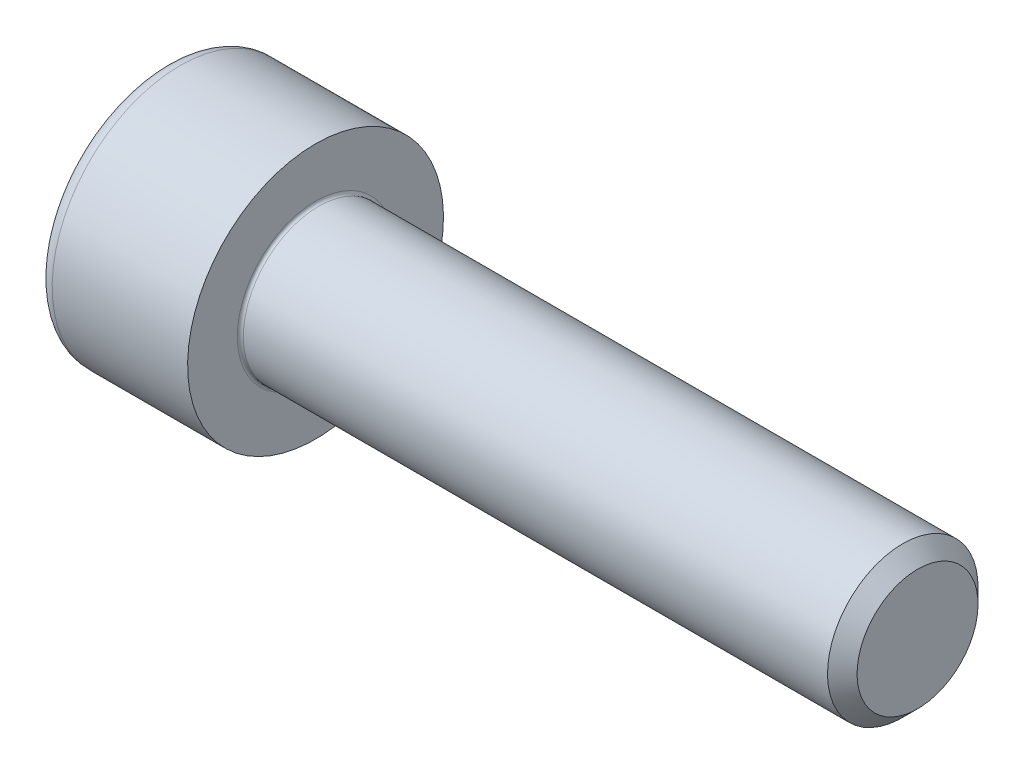
ISO-10303-21;
HEADER;
FILE_DESCRIPTION(('STEP AP214'),'2;1');
FILE_NAME('part.step','',(''),(''),'','','');
FILE_SCHEMA(('AUTOMOTIVE_DESIGN { 1 0 10303 214 1 1 1 1 }'));
ENDSEC;
DATA;
#1=APPLICATION_CONTEXT('core data for automotive mechanical design processes');
#2=APPLICATION_PROTOCOL_DEFINITION('international standard','automotive_design',2000,#1);
#3=PRODUCT_CONTEXT('',#1,'mechanical');
#4=PRODUCT('Part','Part','',(#3));
#5=PRODUCT_RELATED_PRODUCT_CATEGORY('part','',(#4));
#6=PRODUCT_DEFINITION_FORMATION('','',#4);
#7=PRODUCT_DEFINITION_CONTEXT('part definition',#1,'design');
#8=PRODUCT_DEFINITION('design','',#6,#7);
#9=PRODUCT_DEFINITION_SHAPE('','',#8);
#10=(LENGTH_UNIT() NAMED_UNIT(*) SI_UNIT(.MILLI.,.METRE.));
#11=(NAMED_UNIT(*) PLANE_ANGLE_UNIT() SI_UNIT($,.RADIAN.));
#12=(NAMED_UNIT(*) SI_UNIT($,.STERADIAN.) SOLID_ANGLE_UNIT());
#13=UNCERTAINTY_MEASURE_WITH_UNIT(LENGTH_MEASURE(1.E-05),#10,'distance_accuracy_value','');
#14=(GEOMETRIC_REPRESENTATION_CONTEXT(3) GLOBAL_UNCERTAINTY_ASSIGNED_CONTEXT((#13)) GLOBAL_UNIT_ASSIGNED_CONTEXT((#10,
#11,#12)) REPRESENTATION_CONTEXT('',''));
#15=CARTESIAN_POINT('',(0.,0.,0.));
#16=DIRECTION('',(0.,0.,1.));
#17=DIRECTION('',(1.,0.,0.));
#18=AXIS2_PLACEMENT_3D('',#15,#16,#17);
#19=CARTESIAN_POINT('',(-1.83333333333333,0.,0.));
#20=DIRECTION('',(-1.,0.,0.));
#21=DIRECTION('',(0.,1.,0.));
#22=AXIS2_PLACEMENT_3D('',#19,#20,#21);
#23=CONICAL_SURFACE('',#22,1.15470053837925,1.0471975511966);
#24=CARTESIAN_POINT('',(-1.16666666666667,0.,0.));
#25=VERTEX_POINT('',#24);
#26=VERTEX_LOOP('',#25);
#27=FACE_BOUND('',#26,.T.);
#28=CARTESIAN_POINT('',(-2.5,0.,2.30940107675851));
#29=CARTESIAN_POINT('',(-2.16666666666666,1.,1.73205080756886));
#30=CARTESIAN_POINT('',(-2.5,2.,1.15470053837925));
#31=(BOUNDED_CURVE() B_SPLINE_CURVE(2,(#28,#29,#30),.UNSPECIFIED.,.F.,
.F.) B_SPLINE_CURVE_WITH_KNOTS((3,3),(0.,0.233687227615586),
.UNSPECIFIED.) CURVE() GEOMETRIC_REPRESENTATION_ITEM() RATIONAL_B_SPLINE_CURVE((1.,
1.15470053837926,1.)) REPRESENTATION_ITEM(''));
#32=CARTESIAN_POINT('',(-2.5,0.,2.3094010767585));
#33=VERTEX_POINT('',#32);
#34=CARTESIAN_POINT('',(-2.5,2.,1.15470053837925));
#35=VERTEX_POINT('',#34);
#36=EDGE_CURVE('E159',#33,#35,#31,.T.);
#37=ORIENTED_EDGE('',*,*,#36,.T.);
#38=CARTESIAN_POINT('',(-2.5,2.,1.15470053837926));
#39=CARTESIAN_POINT('',(-2.16666666666666,2.,0.));
#40=CARTESIAN_POINT('',(-2.5,2.,-1.15470053837926));
#41=(BOUNDED_CURVE() B_SPLINE_CURVE(2,(#38,#39,#40),.UNSPECIFIED.,.F.,
.F.) B_SPLINE_CURVE_WITH_KNOTS((3,3),(0.,0.233687227615586),
.UNSPECIFIED.) CURVE() GEOMETRIC_REPRESENTATION_ITEM() RATIONAL_B_SPLINE_CURVE((1.,
1.15470053837926,1.)) REPRESENTATION_ITEM(''));
#42=CARTESIAN_POINT('',(-2.5,2.,-1.15470053837925));
#43=VERTEX_POINT('',#42);
#44=EDGE_CURVE('E183',#35,#43,#41,.T.);
#45=ORIENTED_EDGE('',*,*,#44,.T.);
#46=CARTESIAN_POINT('',(-2.5,2.,-1.15470053837925));
#47=CARTESIAN_POINT('',(-2.16666666666666,1.,-1.73205080756888));
#48=CARTESIAN_POINT('',(-2.5,0.,-2.30940107675851));
#49=(BOUNDED_CURVE() B_SPLINE_CURVE(2,(#46,#47,#48),.UNSPECIFIED.,.F.,
.F.) B_SPLINE_CURVE_WITH_KNOTS((3,3),(0.,0.233687227615586),
.UNSPECIFIED.) CURVE() GEOMETRIC_REPRESENTATION_ITEM() RATIONAL_B_SPLINE_CURVE((1.,
1.15470053837925,1.)) REPRESENTATION_ITEM(''));
#50=CARTESIAN_POINT('',(-2.5,0.,-2.3094010767585));
#51=VERTEX_POINT('',#50);
#52=EDGE_CURVE('E181',#43,#51,#49,.T.);
#53=ORIENTED_EDGE('',*,*,#52,.T.);
#54=CARTESIAN_POINT('',(-2.5,0.,-2.30940107675851));
#55=CARTESIAN_POINT('',(-2.16666666666666,-1.,-1.73205080756886));
#56=CARTESIAN_POINT('',(-2.5,-2.,-1.15470053837925));
#57=(BOUNDED_CURVE() B_SPLINE_CURVE(2,(#54,#55,#56),.UNSPECIFIED.,.F.,
.F.) B_SPLINE_CURVE_WITH_KNOTS((3,3),(0.,0.233687227615586),
.UNSPECIFIED.) CURVE() GEOMETRIC_REPRESENTATION_ITEM() RATIONAL_B_SPLINE_CURVE((1.,
1.15470053837926,1.)) REPRESENTATION_ITEM(''));
#58=CARTESIAN_POINT('',(-2.5,-2.,-1.15470053837925));
#59=VERTEX_POINT('',#58);
#60=EDGE_CURVE('E129',#51,#59,#57,.T.);
#61=ORIENTED_EDGE('',*,*,#60,.T.);
#62=CARTESIAN_POINT('',(-2.5,-2.,-1.15470053837926));
#63=CARTESIAN_POINT('',(-2.16666666666666,-2.,0.));
#64=CARTESIAN_POINT('',(-2.5,-2.,1.15470053837926));
#65=(BOUNDED_CURVE() B_SPLINE_CURVE(2,(#62,#63,#64),.UNSPECIFIED.,.F.,
.F.) B_SPLINE_CURVE_WITH_KNOTS((3,3),(0.,0.233687227615586),
.UNSPECIFIED.) CURVE() GEOMETRIC_REPRESENTATION_ITEM() RATIONAL_B_SPLINE_CURVE((1.,
1.15470053837925,1.)) REPRESENTATION_ITEM(''));
#66=CARTESIAN_POINT('',(-2.5,-2.,1.15470053837925));
#67=VERTEX_POINT('',#66);
#68=EDGE_CURVE('E180',#59,#67,#65,.T.);
#69=ORIENTED_EDGE('',*,*,#68,.T.);
#70=CARTESIAN_POINT('',(-2.5,-2.,1.15470053837925));
#71=CARTESIAN_POINT('',(-2.16666666666666,-1.,1.73205080756886));
#72=CARTESIAN_POINT('',(-2.5,0.,2.30940107675851));
#73=(BOUNDED_CURVE() B_SPLINE_CURVE(2,(#70,#71,#72),.UNSPECIFIED.,.F.,
.F.) B_SPLINE_CURVE_WITH_KNOTS((3,3),(0.,0.233687227615586),
.UNSPECIFIED.) CURVE() GEOMETRIC_REPRESENTATION_ITEM() RATIONAL_B_SPLINE_CURVE((1.,
1.15470053837926,1.)) REPRESENTATION_ITEM(''));
#74=EDGE_CURVE('E11',#67,#33,#73,.T.);
#75=ORIENTED_EDGE('',*,*,#74,.T.);
#76=EDGE_LOOP('',(#37,#45,#53,#61,#69,#75));
#77=FACE_BOUND('',#76,.T.);
#78=ADVANCED_FACE('F16',(#27,#77),#23,.F.);
#79=CARTESIAN_POINT('',(-5.,-2.,1.15470053837925));
#80=DIRECTION('',(0.,-0.5,0.866025403784439));
#81=DIRECTION('',(-1.,0.,0.));
#82=AXIS2_PLACEMENT_3D('',#79,#80,#81);
#83=PLANE('',#82);
#84=ORIENTED_EDGE('',*,*,#74,.F.);
#85=DIRECTION('',(-1.,0.,0.));
#86=VECTOR('',#85,1.);
#87=CARTESIAN_POINT('',(-3.75,-2.,1.15470053837925));
#88=LINE('',#87,#86);
#89=CARTESIAN_POINT('',(-5.,-2.,1.15470053837925));
#90=VERTEX_POINT('',#89);
#91=EDGE_CURVE('E26',#67,#90,#88,.T.);
#92=ORIENTED_EDGE('',*,*,#91,.T.);
#93=DIRECTION('',(0.,-0.866025403784439,-0.5));
#94=VECTOR('',#93,1.);
#95=CARTESIAN_POINT('',(-5.,-1.5,1.44337567297406));
#96=LINE('',#95,#94);
#97=CARTESIAN_POINT('',(-5.,0.,2.3094010767585));
#98=VERTEX_POINT('',#97);
#99=EDGE_CURVE('E154',#98,#90,#96,.T.);
#100=ORIENTED_EDGE('',*,*,#99,.F.);
#101=DIRECTION('',(1.,0.,0.));
#102=VECTOR('',#101,1.);
#103=CARTESIAN_POINT('',(-3.75,0.,2.3094010767585));
#104=LINE('',#103,#102);
#105=EDGE_CURVE('E83',#98,#33,#104,.T.);
#106=ORIENTED_EDGE('',*,*,#105,.T.);
#107=EDGE_LOOP('',(#84,#92,#100,#106));
#108=FACE_BOUND('',#107,.T.);
#109=ADVANCED_FACE('F253',(#108),#83,.F.);
#110=CARTESIAN_POINT('',(-5.,-2.,-1.15470053837925));
#111=DIRECTION('',(0.,-1.,0.));
#112=DIRECTION('',(-1.,0.,0.));
#113=AXIS2_PLACEMENT_3D('',#110,#111,#112);
#114=PLANE('',#113);
#115=ORIENTED_EDGE('',*,*,#68,.F.);
#116=DIRECTION('',(-1.,0.,0.));
#117=VECTOR('',#116,1.);
#118=CARTESIAN_POINT('',(-3.75,-2.,-1.15470053837925));
#119=LINE('',#118,#117);
#120=CARTESIAN_POINT('',(-5.,-2.,-1.15470053837925));
#121=VERTEX_POINT('',#120);
#122=EDGE_CURVE('E20',#59,#121,#119,.T.);
#123=ORIENTED_EDGE('',*,*,#122,.T.);
#124=DIRECTION('',(0.,0.,-1.));
#125=VECTOR('',#124,1.);
#126=CARTESIAN_POINT('',(-5.,-2.,-0.577350269189625));
#127=LINE('',#126,#125);
#128=EDGE_CURVE('E147',#90,#121,#127,.T.);
#129=ORIENTED_EDGE('',*,*,#128,.F.);
#130=ORIENTED_EDGE('',*,*,#91,.F.);
#131=EDGE_LOOP('',(#115,#123,#129,#130));
#132=FACE_BOUND('',#131,.T.);
#133=ADVANCED_FACE('F264',(#132),#114,.F.);
#134=CARTESIAN_POINT('',(-5.,0.,2.3094010767585));
#135=DIRECTION('',(0.,0.5,0.866025403784439));
#136=DIRECTION('',(1.,0.,0.));
#137=AXIS2_PLACEMENT_3D('',#134,#135,#136);
#138=PLANE('',#137);
#139=ORIENTED_EDGE('',*,*,#36,.F.);
#140=ORIENTED_EDGE('',*,*,#105,.F.);
#141=DIRECTION('',(0.,-0.866025403784439,0.5));
#142=VECTOR('',#141,1.);
#143=CARTESIAN_POINT('',(-5.,0.5,2.02072594216369));
#144=LINE('',#143,#142);
#145=CARTESIAN_POINT('',(-5.,2.,1.15470053837925));
#146=VERTEX_POINT('',#145);
#147=EDGE_CURVE('E169',#146,#98,#144,.T.);
#148=ORIENTED_EDGE('',*,*,#147,.F.);
#149=DIRECTION('',(-1.,0.,0.));
#150=VECTOR('',#149,1.);
#151=CARTESIAN_POINT('',(-3.75,2.,1.15470053837925));
#152=LINE('',#151,#150);
#153=EDGE_CURVE('E164',#35,#146,#152,.T.);
#154=ORIENTED_EDGE('',*,*,#153,.F.);
#155=EDGE_LOOP('',(#139,#140,#148,#154));
#156=FACE_BOUND('',#155,.T.);
#157=ADVANCED_FACE('F254',(#156),#138,.F.);
#158=CARTESIAN_POINT('',(-5.,2.,1.15470053837925));
#159=DIRECTION('',(0.,1.,0.));
#160=DIRECTION('',(0.,0.,-1.));
#161=AXIS2_PLACEMENT_3D('',#158,#159,#160);
#162=PLANE('',#161);
#163=ORIENTED_EDGE('',*,*,#44,.F.);
#164=ORIENTED_EDGE('',*,*,#153,.T.);
#165=DIRECTION('',(0.,0.,1.));
#166=VECTOR('',#165,1.);
#167=CARTESIAN_POINT('',(-5.,2.,0.577350269189624));
#168=LINE('',#167,#166);
#169=CARTESIAN_POINT('',(-5.,2.,-1.15470053837925));
#170=VERTEX_POINT('',#169);
#171=EDGE_CURVE('E222',#170,#146,#168,.T.);
#172=ORIENTED_EDGE('',*,*,#171,.F.);
#173=DIRECTION('',(-1.,0.,0.));
#174=VECTOR('',#173,1.);
#175=CARTESIAN_POINT('',(-3.75,2.,-1.15470053837925));
#176=LINE('',#175,#174);
#177=EDGE_CURVE('E138',#43,#170,#176,.T.);
#178=ORIENTED_EDGE('',*,*,#177,.F.);
#179=EDGE_LOOP('',(#163,#164,#172,#178));
#180=FACE_BOUND('',#179,.T.);
#181=ADVANCED_FACE('F255',(#180),#162,.F.);
#182=CARTESIAN_POINT('',(-5.,2.,-1.15470053837925));
#183=DIRECTION('',(0.,0.5,-0.866025403784439));
#184=DIRECTION('',(-1.,0.,0.));
#185=AXIS2_PLACEMENT_3D('',#182,#183,#184);
#186=PLANE('',#185);
#187=ORIENTED_EDGE('',*,*,#52,.F.);
#188=ORIENTED_EDGE('',*,*,#177,.T.);
#189=DIRECTION('',(0.,0.866025403784439,0.5));
#190=VECTOR('',#189,1.);
#191=CARTESIAN_POINT('',(-5.,1.5,-1.44337567297407));
#192=LINE('',#191,#190);
#193=CARTESIAN_POINT('',(-5.,0.,-2.3094010767585));
#194=VERTEX_POINT('',#193);
#195=EDGE_CURVE('E135',#194,#170,#192,.T.);
#196=ORIENTED_EDGE('',*,*,#195,.F.);
#197=DIRECTION('',(-1.,0.,0.));
#198=VECTOR('',#197,1.);
#199=CARTESIAN_POINT('',(-3.75,0.,-2.3094010767585));
#200=LINE('',#199,#198);
#201=EDGE_CURVE('E121',#51,#194,#200,.T.);
#202=ORIENTED_EDGE('',*,*,#201,.F.);
#203=EDGE_LOOP('',(#187,#188,#196,#202));
#204=FACE_BOUND('',#203,.T.);
#205=ADVANCED_FACE('F136',(#204),#186,.F.);
#206=CARTESIAN_POINT('',(-5.,0.,-2.3094010767585));
#207=DIRECTION('',(0.,-0.5,-0.866025403784439));
#208=DIRECTION('',(0.,-0.866025403784439,0.5));
#209=AXIS2_PLACEMENT_3D('',#206,#207,#208);
#210=PLANE('',#209);
#211=ORIENTED_EDGE('',*,*,#60,.F.);
#212=ORIENTED_EDGE('',*,*,#201,.T.);
#213=DIRECTION('',(0.,0.866025403784439,-0.5));
#214=VECTOR('',#213,1.);
#215=CARTESIAN_POINT('',(-5.,-0.5,-2.02072594216369));
#216=LINE('',#215,#214);
#217=EDGE_CURVE('E126',#121,#194,#216,.T.);
#218=ORIENTED_EDGE('',*,*,#217,.F.);
#219=ORIENTED_EDGE('',*,*,#122,.F.);
#220=EDGE_LOOP('',(#211,#212,#218,#219));
#221=FACE_BOUND('',#220,.T.);
#222=ADVANCED_FACE('F123',(#221),#210,.F.);
#223=CARTESIAN_POINT('',(-2.5,0.,0.));
#224=DIRECTION('',(1.,0.,0.));
#225=DIRECTION('',(0.,1.,0.));
#226=AXIS2_PLACEMENT_3D('',#223,#224,#225);
#227=CYLINDRICAL_SURFACE('',#226,4.25);
#228=CARTESIAN_POINT('',(-4.5,0.,0.));
#229=DIRECTION('',(-1.,0.,0.));
#230=DIRECTION('',(0.,-1.,0.));
#231=AXIS2_PLACEMENT_3D('',#228,#229,#230);
#232=CIRCLE('',#231,4.25);
#233=CARTESIAN_POINT('',(-4.5,4.25,0.));
#234=VERTEX_POINT('',#233);
#235=EDGE_CURVE('E200',#234,#234,#232,.T.);
#236=ORIENTED_EDGE('',*,*,#235,.F.);
#237=EDGE_LOOP('',(#236));
#238=FACE_BOUND('',#237,.T.);
#239=CARTESIAN_POINT('',(0.,0.,0.));
#240=DIRECTION('',(1.,0.,0.));
#241=DIRECTION('',(0.,1.,0.));
#242=AXIS2_PLACEMENT_3D('',#239,#240,#241);
#243=CIRCLE('',#242,4.25);
#244=CARTESIAN_POINT('',(0.,4.25,0.));
#245=VERTEX_POINT('',#244);
#246=EDGE_CURVE('E217',#245,#245,#243,.T.);
#247=ORIENTED_EDGE('',*,*,#246,.F.);
#248=EDGE_LOOP('',(#247));
#249=FACE_BOUND('',#248,.T.);
#250=ADVANCED_FACE('F282',(#238,#249),#227,.T.);
#251=CARTESIAN_POINT('',(-5.,3.27970053837925,0.));
#252=DIRECTION('',(-1.,0.,0.));
#253=DIRECTION('',(0.,1.,0.));
#254=AXIS2_PLACEMENT_3D('',#251,#252,#253);
#255=PLANE('',#254);
#256=ORIENTED_EDGE('',*,*,#171,.T.);
#257=ORIENTED_EDGE('',*,*,#147,.T.);
#258=ORIENTED_EDGE('',*,*,#99,.T.);
#259=ORIENTED_EDGE('',*,*,#128,.T.);
#260=ORIENTED_EDGE('',*,*,#217,.T.);
#261=ORIENTED_EDGE('',*,*,#195,.T.);
#262=EDGE_LOOP('',(#256,#257,#258,#259,#260,#261));
#263=FACE_BOUND('',#262,.T.);
#264=CARTESIAN_POINT('',(-5.,0.,0.));
#265=DIRECTION('',(1.,0.,0.));
#266=DIRECTION('',(0.,-1.,0.));
#267=AXIS2_PLACEMENT_3D('',#264,#265,#266);
#268=CIRCLE('',#267,3.75);
#269=CARTESIAN_POINT('',(-5.,3.75,0.));
#270=VERTEX_POINT('',#269);
#271=EDGE_CURVE('E194',#270,#270,#268,.T.);
#272=ORIENTED_EDGE('',*,*,#271,.F.);
#273=EDGE_LOOP('',(#272));
#274=FACE_BOUND('',#273,.T.);
#275=ADVANCED_FACE('F144',(#263,#274),#255,.T.);
#276=CARTESIAN_POINT('',(-4.5,0.,0.));
#277=DIRECTION('',(1.,0.,0.));
#278=DIRECTION('',(0.,0.,-1.));
#279=AXIS2_PLACEMENT_3D('',#276,#277,#278);
#280=TOROIDAL_SURFACE('',#279,3.75,0.5);
#281=ORIENTED_EDGE('',*,*,#235,.T.);
#282=EDGE_LOOP('',(#281));
#283=FACE_BOUND('',#282,.T.);
#284=ORIENTED_EDGE('',*,*,#271,.T.);
#285=EDGE_LOOP('',(#284));
#286=FACE_BOUND('',#285,.T.);
#287=ADVANCED_FACE('F279',(#283,#286),#280,.T.);
#288=CARTESIAN_POINT('',(20.,1.25,0.));
#289=DIRECTION('',(1.,0.,0.));
#290=DIRECTION('',(0.,1.,0.));
#291=AXIS2_PLACEMENT_3D('',#288,#289,#290);
#292=PLANE('',#291);
#293=CARTESIAN_POINT('',(20.,0.,0.));
#294=DIRECTION('',(-1.,0.,0.));
#295=DIRECTION('',(0.,-1.,0.));
#296=AXIS2_PLACEMENT_3D('',#293,#294,#295);
#297=CIRCLE('',#296,2.00924);
#298=CARTESIAN_POINT('',(20.,2.00924,0.));
#299=VERTEX_POINT('',#298);
#300=EDGE_CURVE('E201',#299,#299,#297,.T.);
#301=ORIENTED_EDGE('',*,*,#300,.F.);
#302=EDGE_LOOP('',(#301));
#303=FACE_BOUND('',#302,.T.);
#304=ADVANCED_FACE('F276',(#303),#292,.T.);
#305=CARTESIAN_POINT('',(19.75462,0.,0.));
#306=DIRECTION('',(-1.,0.,0.));
#307=DIRECTION('',(0.,-1.,0.));
#308=AXIS2_PLACEMENT_3D('',#305,#306,#307);
#309=CONICAL_SURFACE('',#308,2.25462,0.785398163397445);
#310=ORIENTED_EDGE('',*,*,#300,.T.);
#311=EDGE_LOOP('',(#310));
#312=FACE_BOUND('',#311,.T.);
#313=CARTESIAN_POINT('',(19.50924,0.,0.));
#314=DIRECTION('',(1.,0.,0.));
#315=DIRECTION('',(0.,-1.,0.));
#316=AXIS2_PLACEMENT_3D('',#313,#314,#315);
#317=CIRCLE('',#316,2.5);
#318=CARTESIAN_POINT('',(19.50924,2.5,0.));
#319=VERTEX_POINT('',#318);
#320=EDGE_CURVE('E205',#319,#319,#317,.T.);
#321=ORIENTED_EDGE('',*,*,#320,.T.);
#322=EDGE_LOOP('',(#321));
#323=FACE_BOUND('',#322,.T.);
#324=ADVANCED_FACE('F278',(#312,#323),#309,.T.);
#325=CARTESIAN_POINT('',(0.,3.375,0.));
#326=DIRECTION('',(1.,0.,0.));
#327=DIRECTION('',(0.,1.,0.));
#328=AXIS2_PLACEMENT_3D('',#325,#326,#327);
#329=PLANE('',#328);
#330=CARTESIAN_POINT('',(0.,0.,0.));
#331=DIRECTION('',(1.,0.,0.));
#332=DIRECTION('',(0.,-1.,0.));
#333=AXIS2_PLACEMENT_3D('',#330,#331,#332);
#334=CIRCLE('',#333,2.6);
#335=CARTESIAN_POINT('',(0.,2.6,0.));
#336=VERTEX_POINT('',#335);
#337=EDGE_CURVE('E206',#336,#336,#334,.T.);
#338=ORIENTED_EDGE('',*,*,#337,.F.);
#339=EDGE_LOOP('',(#338));
#340=FACE_BOUND('',#339,.T.);
#341=ORIENTED_EDGE('',*,*,#246,.T.);
#342=EDGE_LOOP('',(#341));
#343=FACE_BOUND('',#342,.T.);
#344=ADVANCED_FACE('F18',(#340,#343),#329,.T.);
#345=CARTESIAN_POINT('',(10.4,0.,0.));
#346=DIRECTION('',(1.,0.,0.));
#347=DIRECTION('',(0.,1.,0.));
#348=AXIS2_PLACEMENT_3D('',#345,#346,#347);
#349=CYLINDRICAL_SURFACE('',#348,2.5);
#350=CARTESIAN_POINT('',(0.100000000000002,0.,0.));
#351=DIRECTION('',(-1.,0.,0.));
#352=DIRECTION('',(0.,-1.,0.));
#353=AXIS2_PLACEMENT_3D('',#350,#351,#352);
#354=CIRCLE('',#353,2.5);
#355=CARTESIAN_POINT('',(0.100000000000002,2.5,0.));
#356=VERTEX_POINT('',#355);
#357=EDGE_CURVE('E202',#356,#356,#354,.T.);
#358=ORIENTED_EDGE('',*,*,#357,.F.);
#359=EDGE_LOOP('',(#358));
#360=FACE_BOUND('',#359,.T.);
#361=ORIENTED_EDGE('',*,*,#320,.F.);
#362=EDGE_LOOP('',(#361));
#363=FACE_BOUND('',#362,.T.);
#364=ADVANCED_FACE('F302',(#360,#363),#349,.T.);
#365=CARTESIAN_POINT('',(0.100000000000002,0.,0.));
#366=DIRECTION('',(1.,0.,0.));
#367=DIRECTION('',(0.,0.,-1.));
#368=AXIS2_PLACEMENT_3D('',#365,#366,#367);
#369=TOROIDAL_SURFACE('',#368,2.6,0.1);
#370=ORIENTED_EDGE('',*,*,#357,.T.);
#371=EDGE_LOOP('',(#370));
#372=FACE_BOUND('',#371,.T.);
#373=ORIENTED_EDGE('',*,*,#337,.T.);
#374=EDGE_LOOP('',(#373));
#375=FACE_BOUND('',#374,.T.);
#376=ADVANCED_FACE('F300',(#372,#375),#369,.F.);
#377=CLOSED_SHELL('',(#78,#109,#133,#157,#181,#205,#222,#250,#275,#287,#304,#324,#344,#364,#376));
#378=MANIFOLD_SOLID_BREP('B1',#377);
#379=ADVANCED_BREP_SHAPE_REPRESENTATION('',(#18,#378),#14);
#380=SHAPE_DEFINITION_REPRESENTATION(#9,#379);
ENDSEC;
END-ISO-10303-21;
